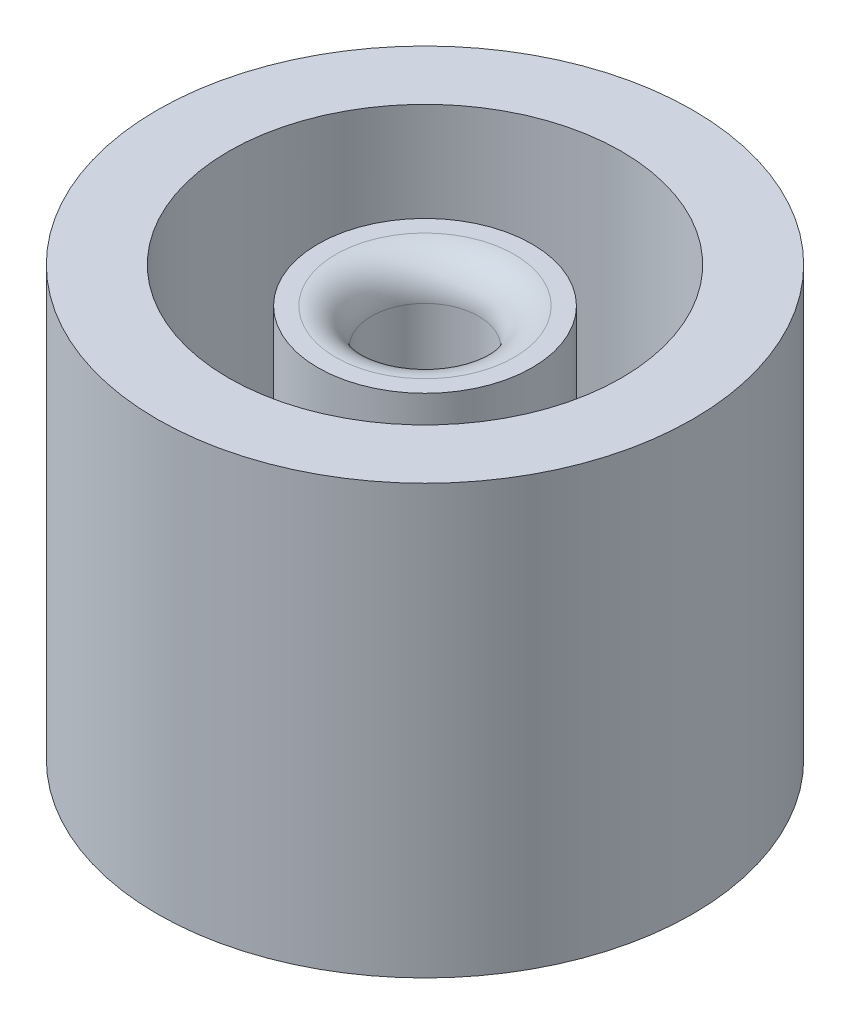
ISO-10303-21;
HEADER;
FILE_DESCRIPTION(('STEP AP214'),'2;1');
FILE_NAME('part.step','',(''),(''),'','','');
FILE_SCHEMA(('AUTOMOTIVE_DESIGN { 1 0 10303 214 1 1 1 1 }'));
ENDSEC;
DATA;
#1=APPLICATION_CONTEXT('core data for automotive mechanical design processes');
#2=APPLICATION_PROTOCOL_DEFINITION('international standard','automotive_design',2000,#1);
#3=PRODUCT_CONTEXT('',#1,'mechanical');
#4=PRODUCT('Part','Part','',(#3));
#5=PRODUCT_RELATED_PRODUCT_CATEGORY('part','',(#4));
#6=PRODUCT_DEFINITION_FORMATION('','',#4);
#7=PRODUCT_DEFINITION_CONTEXT('part definition',#1,'design');
#8=PRODUCT_DEFINITION('design','',#6,#7);
#9=PRODUCT_DEFINITION_SHAPE('','',#8);
#10=(LENGTH_UNIT() NAMED_UNIT(*) SI_UNIT(.MILLI.,.METRE.));
#11=(NAMED_UNIT(*) PLANE_ANGLE_UNIT() SI_UNIT($,.RADIAN.));
#12=(NAMED_UNIT(*) SI_UNIT($,.STERADIAN.) SOLID_ANGLE_UNIT());
#13=UNCERTAINTY_MEASURE_WITH_UNIT(LENGTH_MEASURE(1.E-05),#10,'distance_accuracy_value','');
#14=(GEOMETRIC_REPRESENTATION_CONTEXT(3) GLOBAL_UNCERTAINTY_ASSIGNED_CONTEXT((#13)) GLOBAL_UNIT_ASSIGNED_CONTEXT((#10,
#11,#12)) REPRESENTATION_CONTEXT('',''));
#15=CARTESIAN_POINT('',(0.,0.,0.));
#16=DIRECTION('',(0.,0.,1.));
#17=DIRECTION('',(1.,0.,0.));
#18=AXIS2_PLACEMENT_3D('',#15,#16,#17);
#19=CARTESIAN_POINT('',(0.,6.35,0.));
#20=DIRECTION('',(0.,-1.,0.));
#21=DIRECTION('',(0.,0.,-1.));
#22=AXIS2_PLACEMENT_3D('',#19,#20,#21);
#23=PLANE('',#22);
#24=CARTESIAN_POINT('',(0.,6.35,0.));
#25=DIRECTION('',(0.,-1.,0.));
#26=DIRECTION('',(0.,0.,-1.));
#27=AXIS2_PLACEMENT_3D('',#24,#25,#26);
#28=CIRCLE('',#27,13.97);
#29=CARTESIAN_POINT('',(0.,6.35,-13.97));
#30=VERTEX_POINT('',#29);
#31=EDGE_CURVE('E71',#30,#30,#28,.T.);
#32=ORIENTED_EDGE('',*,*,#31,.F.);
#33=EDGE_LOOP('',(#32));
#34=FACE_BOUND('',#33,.T.);
#35=CARTESIAN_POINT('',(0.,6.35,0.));
#36=DIRECTION('',(0.,-1.,0.));
#37=DIRECTION('',(0.,0.,-1.));
#38=AXIS2_PLACEMENT_3D('',#35,#36,#37);
#39=CIRCLE('',#38,7.62);
#40=CARTESIAN_POINT('',(0.,6.35,-7.62));
#41=VERTEX_POINT('',#40);
#42=EDGE_CURVE('E52',#41,#41,#39,.F.);
#43=ORIENTED_EDGE('',*,*,#42,.F.);
#44=EDGE_LOOP('',(#43));
#45=FACE_BOUND('',#44,.T.);
#46=ADVANCED_FACE('F39',(#34,#45),#23,.F.);
#47=CARTESIAN_POINT('',(0.,30.48,0.));
#48=DIRECTION('',(0.,-1.,0.));
#49=DIRECTION('',(0.,0.,-1.));
#50=AXIS2_PLACEMENT_3D('',#47,#48,#49);
#51=CYLINDRICAL_SURFACE('',#50,13.97);
#52=CARTESIAN_POINT('',(0.,30.48,0.));
#53=DIRECTION('',(0.,1.,0.));
#54=DIRECTION('',(0.,0.,1.));
#55=AXIS2_PLACEMENT_3D('',#52,#53,#54);
#56=CIRCLE('',#55,13.97);
#57=CARTESIAN_POINT('',(0.,30.48,13.97));
#58=VERTEX_POINT('',#57);
#59=EDGE_CURVE('E64',#58,#58,#56,.T.);
#60=ORIENTED_EDGE('',*,*,#59,.T.);
#61=EDGE_LOOP('',(#60));
#62=FACE_BOUND('',#61,.T.);
#63=ORIENTED_EDGE('',*,*,#31,.T.);
#64=EDGE_LOOP('',(#63));
#65=FACE_BOUND('',#64,.T.);
#66=ADVANCED_FACE('F106',(#62,#65),#51,.F.);
#67=CARTESIAN_POINT('',(0.,30.48,0.));
#68=DIRECTION('',(0.,1.,0.));
#69=DIRECTION('',(0.,0.,1.));
#70=AXIS2_PLACEMENT_3D('',#67,#68,#69);
#71=PLANE('',#70);
#72=CARTESIAN_POINT('',(0.,30.48,0.));
#73=DIRECTION('',(0.,1.,0.));
#74=DIRECTION('',(0.,0.,1.));
#75=AXIS2_PLACEMENT_3D('',#72,#73,#74);
#76=CIRCLE('',#75,19.05);
#77=CARTESIAN_POINT('',(0.,30.48,19.05));
#78=VERTEX_POINT('',#77);
#79=EDGE_CURVE('E57',#78,#78,#76,.T.);
#80=ORIENTED_EDGE('',*,*,#79,.T.);
#81=EDGE_LOOP('',(#80));
#82=FACE_BOUND('',#81,.T.);
#83=ORIENTED_EDGE('',*,*,#59,.F.);
#84=EDGE_LOOP('',(#83));
#85=FACE_BOUND('',#84,.T.);
#86=ADVANCED_FACE('F112',(#82,#85),#71,.T.);
#87=CARTESIAN_POINT('',(0.,0.,0.));
#88=DIRECTION('',(0.,1.,0.));
#89=DIRECTION('',(0.,0.,1.));
#90=AXIS2_PLACEMENT_3D('',#87,#88,#89);
#91=PLANE('',#90);
#92=CARTESIAN_POINT('',(0.,0.,0.));
#93=DIRECTION('',(0.,1.,0.));
#94=DIRECTION('',(0.,0.,1.));
#95=AXIS2_PLACEMENT_3D('',#92,#93,#94);
#96=CIRCLE('',#95,5.08);
#97=CARTESIAN_POINT('',(0.,0.,5.08));
#98=VERTEX_POINT('',#97);
#99=EDGE_CURVE('E75',#98,#98,#96,.T.);
#100=ORIENTED_EDGE('',*,*,#99,.T.);
#101=EDGE_LOOP('',(#100));
#102=FACE_BOUND('',#101,.T.);
#103=CARTESIAN_POINT('',(0.,0.,0.));
#104=DIRECTION('',(0.,1.,0.));
#105=DIRECTION('',(0.,0.,1.));
#106=AXIS2_PLACEMENT_3D('',#103,#104,#105);
#107=CIRCLE('',#106,19.05);
#108=CARTESIAN_POINT('',(0.,0.,19.05));
#109=VERTEX_POINT('',#108);
#110=EDGE_CURVE('E60',#109,#109,#107,.T.);
#111=ORIENTED_EDGE('',*,*,#110,.F.);
#112=EDGE_LOOP('',(#111));
#113=FACE_BOUND('',#112,.T.);
#114=ADVANCED_FACE('F123',(#102,#113),#91,.F.);
#115=CARTESIAN_POINT('',(0.,30.48,0.));
#116=DIRECTION('',(0.,-1.,0.));
#117=DIRECTION('',(0.,0.,-1.));
#118=AXIS2_PLACEMENT_3D('',#115,#116,#117);
#119=CYLINDRICAL_SURFACE('',#118,19.05);
#120=ORIENTED_EDGE('',*,*,#79,.F.);
#121=EDGE_LOOP('',(#120));
#122=FACE_BOUND('',#121,.T.);
#123=ORIENTED_EDGE('',*,*,#110,.T.);
#124=EDGE_LOOP('',(#123));
#125=FACE_BOUND('',#124,.T.);
#126=ADVANCED_FACE('F126',(#122,#125),#119,.T.);
#127=CARTESIAN_POINT('',(0.,0.,0.));
#128=DIRECTION('',(0.,1.,0.));
#129=DIRECTION('',(0.,0.,1.));
#130=AXIS2_PLACEMENT_3D('',#127,#128,#129);
#131=CYLINDRICAL_SURFACE('',#130,5.08);
#132=ORIENTED_EDGE('',*,*,#99,.F.);
#133=EDGE_LOOP('',(#132));
#134=FACE_BOUND('',#133,.T.);
#135=CARTESIAN_POINT('',(0.,20.32,0.));
#136=DIRECTION('',(0.,1.,0.));
#137=DIRECTION('',(0.,0.,1.));
#138=AXIS2_PLACEMENT_3D('',#135,#136,#137);
#139=CIRCLE('',#138,5.08);
#140=CARTESIAN_POINT('',(0.,20.32,5.08));
#141=VERTEX_POINT('',#140);
#142=EDGE_CURVE('E79',#141,#141,#139,.T.);
#143=ORIENTED_EDGE('',*,*,#142,.T.);
#144=EDGE_LOOP('',(#143));
#145=FACE_BOUND('',#144,.T.);
#146=ADVANCED_FACE('F118',(#134,#145),#131,.F.);
#147=CARTESIAN_POINT('',(0.,20.32,0.));
#148=DIRECTION('',(0.,-1.,0.));
#149=DIRECTION('',(0.,0.,-1.));
#150=AXIS2_PLACEMENT_3D('',#147,#148,#149);
#151=CYLINDRICAL_SURFACE('',#150,7.62);
#152=ORIENTED_EDGE('',*,*,#42,.T.);
#153=EDGE_LOOP('',(#152));
#154=FACE_BOUND('',#153,.T.);
#155=CARTESIAN_POINT('',(0.,27.94,0.));
#156=DIRECTION('',(0.,1.,0.));
#157=DIRECTION('',(0.,0.,1.));
#158=AXIS2_PLACEMENT_3D('',#155,#156,#157);
#159=CIRCLE('',#158,7.62);
#160=CARTESIAN_POINT('',(0.,27.94,7.62));
#161=VERTEX_POINT('',#160);
#162=EDGE_CURVE('E83',#161,#161,#159,.T.);
#163=ORIENTED_EDGE('',*,*,#162,.F.);
#164=EDGE_LOOP('',(#163));
#165=FACE_BOUND('',#164,.T.);
#166=ADVANCED_FACE('F133',(#154,#165),#151,.T.);
#167=CARTESIAN_POINT('',(0.,20.32,0.));
#168=DIRECTION('',(0.,1.,0.));
#169=DIRECTION('',(0.,0.,1.));
#170=AXIS2_PLACEMENT_3D('',#167,#168,#169);
#171=PLANE('',#170);
#172=CARTESIAN_POINT('',(0.,20.32,0.));
#173=DIRECTION('',(0.,1.,0.));
#174=DIRECTION('',(0.,0.,1.));
#175=AXIS2_PLACEMENT_3D('',#172,#173,#174);
#176=CIRCLE('',#175,3.81);
#177=CARTESIAN_POINT('',(0.,20.32,3.81));
#178=VERTEX_POINT('',#177);
#179=EDGE_CURVE('E87',#178,#178,#176,.T.);
#180=ORIENTED_EDGE('',*,*,#179,.T.);
#181=EDGE_LOOP('',(#180));
#182=FACE_BOUND('',#181,.T.);
#183=ORIENTED_EDGE('',*,*,#142,.F.);
#184=EDGE_LOOP('',(#183));
#185=FACE_BOUND('',#184,.T.);
#186=ADVANCED_FACE('F92',(#182,#185),#171,.F.);
#187=CARTESIAN_POINT('',(0.,27.94,0.));
#188=DIRECTION('',(0.,1.,0.));
#189=DIRECTION('',(0.,0.,1.));
#190=AXIS2_PLACEMENT_3D('',#187,#188,#189);
#191=PLANE('',#190);
#192=CARTESIAN_POINT('',(0.,27.94,0.));
#193=DIRECTION('',(0.,1.,0.));
#194=DIRECTION('',(0.,0.,1.));
#195=AXIS2_PLACEMENT_3D('',#192,#193,#194);
#196=CIRCLE('',#195,6.35);
#197=CARTESIAN_POINT('',(0.,27.94,6.35));
#198=VERTEX_POINT('',#197);
#199=EDGE_CURVE('E10',#198,#198,#196,.F.);
#200=ORIENTED_EDGE('',*,*,#199,.T.);
#201=EDGE_LOOP('',(#200));
#202=FACE_BOUND('',#201,.T.);
#203=ORIENTED_EDGE('',*,*,#162,.T.);
#204=EDGE_LOOP('',(#203));
#205=FACE_BOUND('',#204,.T.);
#206=ADVANCED_FACE('F97',(#202,#205),#191,.T.);
#207=CARTESIAN_POINT('',(0.,27.94,0.));
#208=DIRECTION('',(0.,-1.,0.));
#209=DIRECTION('',(0.,0.,-1.));
#210=AXIS2_PLACEMENT_3D('',#207,#208,#209);
#211=CYLINDRICAL_SURFACE('',#210,3.81);
#212=CARTESIAN_POINT('',(0.,25.4,0.));
#213=DIRECTION('',(0.,1.,0.));
#214=DIRECTION('',(0.,0.,1.));
#215=AXIS2_PLACEMENT_3D('',#212,#213,#214);
#216=CIRCLE('',#215,3.81);
#217=CARTESIAN_POINT('',(0.,25.4,3.81));
#218=VERTEX_POINT('',#217);
#219=EDGE_CURVE('E47',#218,#218,#216,.T.);
#220=ORIENTED_EDGE('',*,*,#219,.T.);
#221=EDGE_LOOP('',(#220));
#222=FACE_BOUND('',#221,.T.);
#223=ORIENTED_EDGE('',*,*,#179,.F.);
#224=EDGE_LOOP('',(#223));
#225=FACE_BOUND('',#224,.T.);
#226=ADVANCED_FACE('F95',(#222,#225),#211,.F.);
#227=CARTESIAN_POINT('',(0.,25.4,0.));
#228=DIRECTION('',(0.,1.,0.));
#229=DIRECTION('',(0.,0.,1.));
#230=AXIS2_PLACEMENT_3D('',#227,#228,#229);
#231=TOROIDAL_SURFACE('',#230,6.35,2.54);
#232=ORIENTED_EDGE('',*,*,#199,.F.);
#233=EDGE_LOOP('',(#232));
#234=FACE_BOUND('',#233,.T.);
#235=ORIENTED_EDGE('',*,*,#219,.F.);
#236=EDGE_LOOP('',(#235));
#237=FACE_BOUND('',#236,.T.);
#238=ADVANCED_FACE('F41',(#234,#237),#231,.T.);
#239=CLOSED_SHELL('',(#46,#66,#86,#114,#126,#146,#166,#186,#206,#226,#238));
#240=MANIFOLD_SOLID_BREP('B2',#239);
#241=ADVANCED_BREP_SHAPE_REPRESENTATION('',(#18,#240),#14);
#242=SHAPE_DEFINITION_REPRESENTATION(#9,#241);
ENDSEC;
END-ISO-10303-21;
